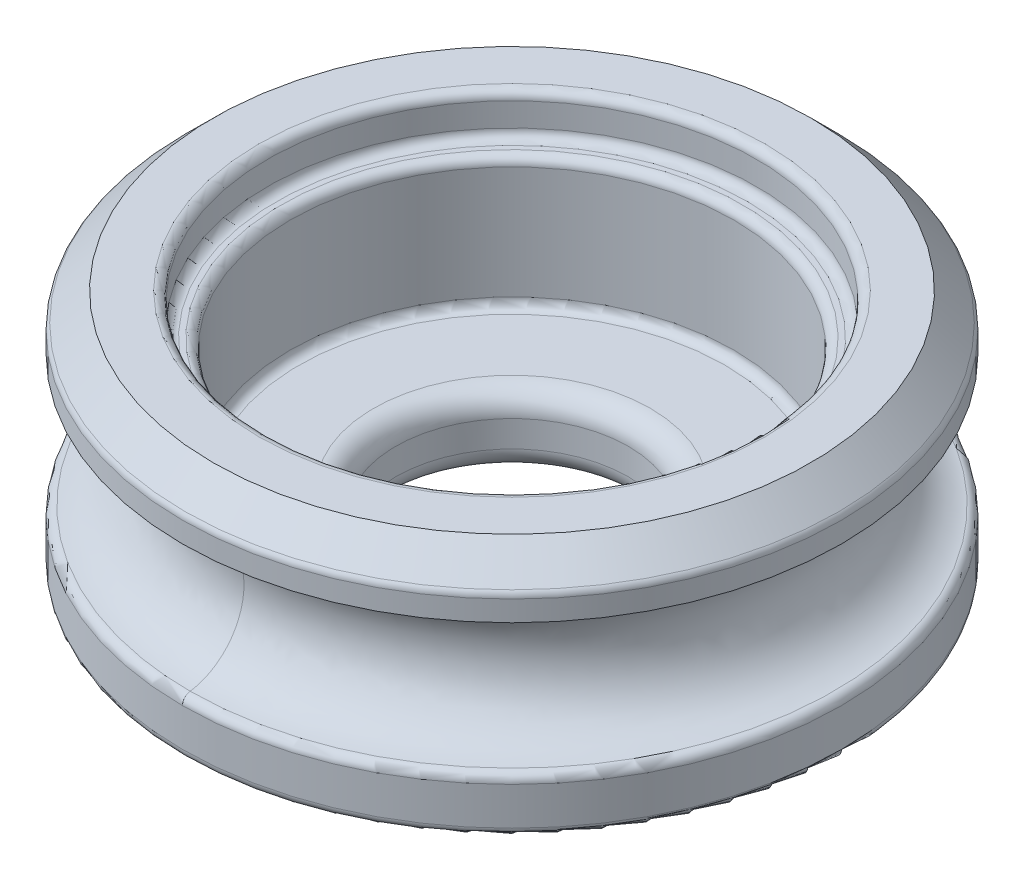
ISO-10303-21;
HEADER;
FILE_DESCRIPTION(('STEP AP214'),'2;1');
FILE_NAME('part.step','',(''),(''),'','','');
FILE_SCHEMA(('AUTOMOTIVE_DESIGN { 1 0 10303 214 1 1 1 1 }'));
ENDSEC;
DATA;
#1=APPLICATION_CONTEXT('core data for automotive mechanical design processes');
#2=APPLICATION_PROTOCOL_DEFINITION('international standard','automotive_design',2000,#1);
#3=PRODUCT_CONTEXT('',#1,'mechanical');
#4=PRODUCT('Part','Part','',(#3));
#5=PRODUCT_RELATED_PRODUCT_CATEGORY('part','',(#4));
#6=PRODUCT_DEFINITION_FORMATION('','',#4);
#7=PRODUCT_DEFINITION_CONTEXT('part definition',#1,'design');
#8=PRODUCT_DEFINITION('design','',#6,#7);
#9=PRODUCT_DEFINITION_SHAPE('','',#8);
#10=(LENGTH_UNIT() NAMED_UNIT(*) SI_UNIT(.MILLI.,.METRE.));
#11=(NAMED_UNIT(*) PLANE_ANGLE_UNIT() SI_UNIT($,.RADIAN.));
#12=(NAMED_UNIT(*) SI_UNIT($,.STERADIAN.) SOLID_ANGLE_UNIT());
#13=UNCERTAINTY_MEASURE_WITH_UNIT(LENGTH_MEASURE(1.E-05),#10,'distance_accuracy_value','');
#14=(GEOMETRIC_REPRESENTATION_CONTEXT(3) GLOBAL_UNCERTAINTY_ASSIGNED_CONTEXT((#13)) GLOBAL_UNIT_ASSIGNED_CONTEXT((#10,
#11,#12)) REPRESENTATION_CONTEXT('',''));
#15=CARTESIAN_POINT('',(0.,0.,0.));
#16=DIRECTION('',(0.,0.,1.));
#17=DIRECTION('',(1.,0.,0.));
#18=AXIS2_PLACEMENT_3D('',#15,#16,#17);
#19=CARTESIAN_POINT('',(0.,6.985,0.));
#20=DIRECTION('',(0.,-1.,0.));
#21=DIRECTION('',(0.,0.,-1.));
#22=AXIS2_PLACEMENT_3D('',#19,#20,#21);
#23=CYLINDRICAL_SURFACE('',#22,9.525);
#24=CARTESIAN_POINT('',(0.,5.99078975515723,0.));
#25=DIRECTION('',(0.,1.,0.));
#26=DIRECTION('',(0.,0.,1.));
#27=AXIS2_PLACEMENT_3D('',#24,#25,#26);
#28=CIRCLE('',#27,9.525);
#29=CARTESIAN_POINT('',(0.,5.99078975515723,9.525));
#30=VERTEX_POINT('',#29);
#31=EDGE_CURVE('E128',#30,#30,#28,.F.);
#32=ORIENTED_EDGE('',*,*,#31,.T.);
#33=EDGE_LOOP('',(#32));
#34=FACE_BOUND('',#33,.T.);
#35=CARTESIAN_POINT('',(0.,5.3975,0.));
#36=DIRECTION('',(0.,-1.,0.));
#37=DIRECTION('',(1.,0.,0.));
#38=AXIS2_PLACEMENT_3D('',#35,#36,#37);
#39=CIRCLE('',#38,9.525);
#40=CARTESIAN_POINT('',(0.,5.3975,9.525));
#41=VERTEX_POINT('',#40);
#42=CARTESIAN_POINT('',(0.,5.3975,-9.525));
#43=VERTEX_POINT('',#42);
#44=EDGE_CURVE('E77',#41,#43,#39,.F.);
#45=ORIENTED_EDGE('',*,*,#44,.T.);
#46=CARTESIAN_POINT('',(0.,5.3975,0.));
#47=DIRECTION('',(0.,-1.,0.));
#48=DIRECTION('',(1.,0.,0.));
#49=AXIS2_PLACEMENT_3D('',#46,#47,#48);
#50=CIRCLE('',#49,9.525);
#51=EDGE_CURVE('E85',#43,#41,#50,.F.);
#52=ORIENTED_EDGE('',*,*,#51,.T.);
#53=EDGE_LOOP('',(#45,#52));
#54=FACE_BOUND('',#53,.T.);
#55=ADVANCED_FACE('F40',(#34,#54),#23,.T.);
#56=CARTESIAN_POINT('',(0.,-18.1401173645597,0.));
#57=DIRECTION('',(0.,1.,0.));
#58=DIRECTION('',(0.,0.,1.));
#59=AXIS2_PLACEMENT_3D('',#56,#57,#58);
#60=CYLINDRICAL_SURFACE('',#59,6.4135);
#61=CARTESIAN_POINT('',(0.,2.286,0.));
#62=DIRECTION('',(0.,-1.,0.));
#63=DIRECTION('',(0.,0.,-1.));
#64=AXIS2_PLACEMENT_3D('',#61,#62,#63);
#65=CIRCLE('',#64,6.4135);
#66=CARTESIAN_POINT('',(0.,2.286,6.4135));
#67=VERTEX_POINT('',#66);
#68=EDGE_CURVE('E11',#67,#67,#65,.T.);
#69=CARTESIAN_POINT('',(0.,5.540375,0.));
#70=DIRECTION('',(0.,1.,0.));
#71=DIRECTION('',(0.,0.,1.));
#72=AXIS2_PLACEMENT_3D('',#69,#70,#71);
#73=CIRCLE('',#72,6.4135);
#74=CARTESIAN_POINT('',(0.,5.540375,6.4135));
#75=VERTEX_POINT('',#74);
#76=EDGE_CURVE('E106',#75,#75,#73,.T.);
#77=CARTESIAN_POINT('',(0.,2.286,6.4135));
#78=CARTESIAN_POINT('',(0.,2.31989973958334,6.4135));
#79=CARTESIAN_POINT('',(0.,2.35379947916667,6.4135));
#80=CARTESIAN_POINT('',(0.,2.42159895833334,6.4135));
#81=CARTESIAN_POINT('',(0.,2.45549869791667,6.4135));
#82=CARTESIAN_POINT('',(0.,2.52329817708334,6.4135));
#83=CARTESIAN_POINT('',(0.,2.55719791666667,6.4135));
#84=CARTESIAN_POINT('',(0.,2.62499739583334,6.4135));
#85=CARTESIAN_POINT('',(0.,2.65889713541667,6.4135));
#86=CARTESIAN_POINT('',(0.,2.72669661458334,6.4135));
#87=CARTESIAN_POINT('',(0.,2.76059635416667,6.4135));
#88=CARTESIAN_POINT('',(0.,2.82839583333334,6.4135));
#89=CARTESIAN_POINT('',(0.,2.86229557291667,6.4135));
#90=CARTESIAN_POINT('',(0.,2.93009505208334,6.4135));
#91=CARTESIAN_POINT('',(0.,2.96399479166667,6.4135));
#92=CARTESIAN_POINT('',(0.,3.03179427083334,6.4135));
#93=CARTESIAN_POINT('',(0.,3.06569401041667,6.4135));
#94=CARTESIAN_POINT('',(0.,3.13349348958334,6.4135));
#95=CARTESIAN_POINT('',(0.,3.16739322916667,6.4135));
#96=CARTESIAN_POINT('',(0.,3.23519270833334,6.4135));
#97=CARTESIAN_POINT('',(0.,3.26909244791667,6.4135));
#98=CARTESIAN_POINT('',(0.,3.33689192708334,6.4135));
#99=CARTESIAN_POINT('',(0.,3.37079166666667,6.4135));
#100=CARTESIAN_POINT('',(0.,3.43859114583334,6.4135));
#101=CARTESIAN_POINT('',(0.,3.47249088541667,6.4135));
#102=CARTESIAN_POINT('',(0.,3.54029036458334,6.4135));
#103=CARTESIAN_POINT('',(0.,3.57419010416667,6.4135));
#104=CARTESIAN_POINT('',(0.,3.64198958333334,6.4135));
#105=CARTESIAN_POINT('',(0.,3.67588932291667,6.4135));
#106=CARTESIAN_POINT('',(0.,3.74368880208334,6.4135));
#107=CARTESIAN_POINT('',(0.,3.77758854166667,6.4135));
#108=CARTESIAN_POINT('',(0.,3.84538802083333,6.4135));
#109=CARTESIAN_POINT('',(0.,3.87928776041667,6.4135));
#110=CARTESIAN_POINT('',(0.,3.94708723958334,6.4135));
#111=CARTESIAN_POINT('',(0.,3.98098697916667,6.4135));
#112=CARTESIAN_POINT('',(0.,4.04878645833334,6.4135));
#113=CARTESIAN_POINT('',(0.,4.08268619791667,6.4135));
#114=CARTESIAN_POINT('',(0.,4.15048567708333,6.4135));
#115=CARTESIAN_POINT('',(0.,4.18438541666667,6.4135));
#116=CARTESIAN_POINT('',(0.,4.25218489583333,6.4135));
#117=CARTESIAN_POINT('',(0.,4.28608463541667,6.4135));
#118=CARTESIAN_POINT('',(0.,4.35388411458334,6.4135));
#119=CARTESIAN_POINT('',(0.,4.38778385416667,6.4135));
#120=CARTESIAN_POINT('',(0.,4.45558333333334,6.4135));
#121=CARTESIAN_POINT('',(0.,4.48948307291667,6.4135));
#122=CARTESIAN_POINT('',(0.,4.55728255208333,6.4135));
#123=CARTESIAN_POINT('',(0.,4.59118229166667,6.4135));
#124=CARTESIAN_POINT('',(0.,4.65898177083333,6.4135));
#125=CARTESIAN_POINT('',(0.,4.69288151041667,6.4135));
#126=CARTESIAN_POINT('',(0.,4.76068098958333,6.4135));
#127=CARTESIAN_POINT('',(0.,4.79458072916667,6.4135));
#128=CARTESIAN_POINT('',(0.,4.86238020833333,6.4135));
#129=CARTESIAN_POINT('',(0.,4.89627994791667,6.4135));
#130=CARTESIAN_POINT('',(0.,4.96407942708333,6.4135));
#131=CARTESIAN_POINT('',(0.,4.99797916666667,6.4135));
#132=CARTESIAN_POINT('',(0.,5.06577864583333,6.4135));
#133=CARTESIAN_POINT('',(0.,5.09967838541667,6.4135));
#134=CARTESIAN_POINT('',(0.,5.16747786458333,6.4135));
#135=CARTESIAN_POINT('',(0.,5.20137760416667,6.4135));
#136=CARTESIAN_POINT('',(0.,5.26917708333333,6.4135));
#137=CARTESIAN_POINT('',(0.,5.30307682291667,6.4135));
#138=CARTESIAN_POINT('',(0.,5.37087630208333,6.4135));
#139=CARTESIAN_POINT('',(0.,5.40477604166667,6.4135));
#140=CARTESIAN_POINT('',(0.,5.47257552083333,6.4135));
#141=CARTESIAN_POINT('',(0.,5.50647526041667,6.4135));
#142=CARTESIAN_POINT('',(0.,5.540375,6.4135));
#143=B_SPLINE_CURVE_WITH_KNOTS('',3,(#77,#78,#79,#80,#81,#82,#83,#84,#85,#86,#87,#88,#89,#90,
#91,#92,#93,#94,#95,#96,#97,#98,#99,#100,#101,#102,#103,#104,#105,#106,#107,#108,#109,#110,#111,
#112,#113,#114,#115,#116,#117,#118,#119,#120,#121,#122,#123,#124,#125,#126,#127,#128,#129,#130,
#131,#132,#133,#134,#135,#136,#137,#138,#139,#140,#141,#142),.UNSPECIFIED.,.F.,.F.,(4,2,2,2,2,2,
2,2,2,2,2,2,2,2,2,2,2,2,2,2,2,2,2,2,2,2,2,2,2,2,2,2,4),(0.,0.101699218750001,0.203398437499999,
0.30509765625,0.406796875000001,0.508496093749998,0.610195312499999,0.71189453125,
0.813593750000001,0.915292968749998,1.0169921875,1.11869140625,1.220390625,1.32208984375,
1.4237890625,1.52548828125,1.6271875,1.72888671875,1.8305859375,1.93228515625,2.033984375,
2.13568359375,2.2373828125,2.33908203125,2.44078125,2.54248046875,2.6441796875,2.74587890625,
2.847578125,2.94927734375,3.0509765625,3.15267578125,3.254375),.UNSPECIFIED.);
#144=EDGE_CURVE('BSEAM180',#67,#75,#143,.T.);
#145=ORIENTED_EDGE('',*,*,#68,.T.);
#146=ORIENTED_EDGE('',*,*,#76,.T.);
#147=ORIENTED_EDGE('',*,*,#144,.T.);
#148=ORIENTED_EDGE('',*,*,#144,.F.);
#149=EDGE_LOOP('',(#145,#147,#146,#148));
#150=FACE_BOUND('',#149,.T.);
#151=ADVANCED_FACE('F180',(#150),#60,.F.);
#152=CARTESIAN_POINT('',(0.,1.35042489048623,0.));
#153=DIRECTION('',(0.,1.,0.));
#154=DIRECTION('',(-1.,0.,0.));
#155=AXIS2_PLACEMENT_3D('',#152,#153,#154);
#156=CIRCLE('',#155,9.525);
#157=CARTESIAN_POINT('',(0.,1.35042489048623,9.525));
#158=VERTEX_POINT('',#157);
#159=CARTESIAN_POINT('',(0.,1.35042489048623,-9.525));
#160=VERTEX_POINT('',#159);
#161=EDGE_CURVE('E115',#158,#160,#156,.F.);
#162=ORIENTED_EDGE('',*,*,#161,.T.);
#163=CARTESIAN_POINT('',(0.,1.35042489048623,0.));
#164=DIRECTION('',(0.,1.,0.));
#165=DIRECTION('',(-1.,0.,0.));
#166=AXIS2_PLACEMENT_3D('',#163,#164,#165);
#167=CIRCLE('',#166,9.525);
#168=EDGE_CURVE('E117',#160,#158,#167,.F.);
#169=ORIENTED_EDGE('',*,*,#168,.T.);
#170=EDGE_LOOP('',(#162,#169));
#171=FACE_BOUND('',#170,.T.);
#172=CARTESIAN_POINT('',(0.,0.254,0.));
#173=DIRECTION('',(0.,1.,0.));
#174=DIRECTION('',(0.,0.,1.));
#175=AXIS2_PLACEMENT_3D('',#172,#173,#174);
#176=CIRCLE('',#175,9.525);
#177=CARTESIAN_POINT('',(0.,0.254,9.525));
#178=VERTEX_POINT('',#177);
#179=EDGE_CURVE('E112',#178,#178,#176,.T.);
#180=ORIENTED_EDGE('',*,*,#179,.T.);
#181=EDGE_LOOP('',(#180));
#182=FACE_BOUND('',#181,.T.);
#183=ADVANCED_FACE('F183',(#171,#182),#23,.T.);
#184=CARTESIAN_POINT('',(0.,6.985,0.));
#185=DIRECTION('',(0.,1.,0.));
#186=DIRECTION('',(0.,0.,1.));
#187=AXIS2_PLACEMENT_3D('',#184,#185,#186);
#188=PLANE('',#187);
#189=CARTESIAN_POINT('',(0.,6.985,0.));
#190=DIRECTION('',(0.,1.,0.));
#191=DIRECTION('',(0.,0.,1.));
#192=AXIS2_PLACEMENT_3D('',#189,#190,#191);
#193=CIRCLE('',#192,8.636);
#194=CARTESIAN_POINT('',(0.,6.985,8.636));
#195=VERTEX_POINT('',#194);
#196=EDGE_CURVE('E109',#195,#195,#193,.T.);
#197=ORIENTED_EDGE('',*,*,#196,.T.);
#198=EDGE_LOOP('',(#197));
#199=FACE_BOUND('',#198,.T.);
#200=CARTESIAN_POINT('',(0.,6.985,0.));
#201=DIRECTION('',(0.,1.,0.));
#202=DIRECTION('',(0.,0.,1.));
#203=AXIS2_PLACEMENT_3D('',#200,#201,#202);
#204=CIRCLE('',#203,7.3263125);
#205=CARTESIAN_POINT('',(0.,6.985,7.3263125));
#206=VERTEX_POINT('',#205);
#207=EDGE_CURVE('E97',#206,#206,#204,.F.);
#208=ORIENTED_EDGE('',*,*,#207,.T.);
#209=EDGE_LOOP('',(#208));
#210=FACE_BOUND('',#209,.T.);
#211=ADVANCED_FACE('F185',(#199,#210),#188,.T.);
#212=CARTESIAN_POINT('',(0.,0.,0.));
#213=DIRECTION('',(0.,1.,0.));
#214=DIRECTION('',(0.,0.,1.));
#215=AXIS2_PLACEMENT_3D('',#212,#213,#214);
#216=PLANE('',#215);
#217=CARTESIAN_POINT('',(0.,0.,0.));
#218=DIRECTION('',(0.,1.,0.));
#219=DIRECTION('',(0.,0.,1.));
#220=AXIS2_PLACEMENT_3D('',#217,#218,#219);
#221=CIRCLE('',#220,4.0005);
#222=CARTESIAN_POINT('',(0.,0.,4.0005));
#223=VERTEX_POINT('',#222);
#224=EDGE_CURVE('E247',#223,#223,#221,.T.);
#225=ORIENTED_EDGE('',*,*,#224,.T.);
#226=EDGE_LOOP('',(#225));
#227=FACE_BOUND('',#226,.T.);
#228=CARTESIAN_POINT('',(0.,0.,0.));
#229=DIRECTION('',(0.,1.,0.));
#230=DIRECTION('',(0.,0.,1.));
#231=AXIS2_PLACEMENT_3D('',#228,#229,#230);
#232=CIRCLE('',#231,9.271);
#233=CARTESIAN_POINT('',(0.,0.,9.271));
#234=VERTEX_POINT('',#233);
#235=EDGE_CURVE('E150',#234,#234,#232,.F.);
#236=ORIENTED_EDGE('',*,*,#235,.T.);
#237=EDGE_LOOP('',(#236));
#238=FACE_BOUND('',#237,.T.);
#239=ADVANCED_FACE('F175',(#227,#238),#216,.F.);
#240=CARTESIAN_POINT('',(0.,5.794375,0.));
#241=DIRECTION('',(0.,1.,0.));
#242=DIRECTION('',(0.,0.,1.));
#243=AXIS2_PLACEMENT_3D('',#240,#241,#242);
#244=PLANE('',#243);
#245=CARTESIAN_POINT('',(0.,5.794375,0.));
#246=DIRECTION('',(0.,1.,0.));
#247=DIRECTION('',(0.,0.,1.));
#248=AXIS2_PLACEMENT_3D('',#245,#246,#247);
#249=CIRCLE('',#248,6.8183125);
#250=CARTESIAN_POINT('',(0.,5.794375,6.8183125));
#251=VERTEX_POINT('',#250);
#252=EDGE_CURVE('E103',#251,#251,#249,.T.);
#253=ORIENTED_EDGE('',*,*,#252,.T.);
#254=EDGE_LOOP('',(#253));
#255=FACE_BOUND('',#254,.T.);
#256=CARTESIAN_POINT('',(0.,5.794375,0.));
#257=DIRECTION('',(0.,1.,0.));
#258=DIRECTION('',(0.,0.,1.));
#259=AXIS2_PLACEMENT_3D('',#256,#257,#258);
#260=CIRCLE('',#259,6.6675);
#261=CARTESIAN_POINT('',(0.,5.794375,6.6675));
#262=VERTEX_POINT('',#261);
#263=EDGE_CURVE('E100',#262,#262,#260,.F.);
#264=ORIENTED_EDGE('',*,*,#263,.T.);
#265=EDGE_LOOP('',(#264));
#266=FACE_BOUND('',#265,.T.);
#267=ADVANCED_FACE('F172',(#255,#266),#244,.T.);
#268=CARTESIAN_POINT('',(0.,5.794375,0.));
#269=DIRECTION('',(0.,1.,0.));
#270=DIRECTION('',(0.,0.,1.));
#271=AXIS2_PLACEMENT_3D('',#268,#269,#270);
#272=CYLINDRICAL_SURFACE('',#271,7.0723125);
#273=CARTESIAN_POINT('',(0.,6.731,0.));
#274=DIRECTION('',(0.,1.,0.));
#275=DIRECTION('',(0.,0.,1.));
#276=AXIS2_PLACEMENT_3D('',#273,#274,#275);
#277=CIRCLE('',#276,7.0723125);
#278=CARTESIAN_POINT('',(0.,6.731,7.0723125));
#279=VERTEX_POINT('',#278);
#280=EDGE_CURVE('E92',#279,#279,#277,.T.);
#281=CARTESIAN_POINT('',(0.,6.048375,0.));
#282=DIRECTION('',(0.,1.,0.));
#283=DIRECTION('',(0.,0.,1.));
#284=AXIS2_PLACEMENT_3D('',#281,#282,#283);
#285=CIRCLE('',#284,7.0723125);
#286=CARTESIAN_POINT('',(0.,6.048375,7.0723125));
#287=VERTEX_POINT('',#286);
#288=EDGE_CURVE('E89',#287,#287,#285,.F.);
#289=CARTESIAN_POINT('',(0.,6.731,7.0723125));
#290=CARTESIAN_POINT('',(0.,6.72388932291667,7.0723125));
#291=CARTESIAN_POINT('',(0.,6.71677864583333,7.0723125));
#292=CARTESIAN_POINT('',(0.,6.70255729166667,7.0723125));
#293=CARTESIAN_POINT('',(0.,6.69544661458333,7.0723125));
#294=CARTESIAN_POINT('',(0.,6.68122526041667,7.0723125));
#295=CARTESIAN_POINT('',(0.,6.67411458333333,7.0723125));
#296=CARTESIAN_POINT('',(0.,6.65989322916667,7.0723125));
#297=CARTESIAN_POINT('',(0.,6.65278255208333,7.0723125));
#298=CARTESIAN_POINT('',(0.,6.63856119791667,7.0723125));
#299=CARTESIAN_POINT('',(0.,6.63145052083333,7.0723125));
#300=CARTESIAN_POINT('',(0.,6.61722916666667,7.0723125));
#301=CARTESIAN_POINT('',(0.,6.61011848958333,7.0723125));
#302=CARTESIAN_POINT('',(0.,6.59589713541667,7.0723125));
#303=CARTESIAN_POINT('',(0.,6.58878645833333,7.0723125));
#304=CARTESIAN_POINT('',(0.,6.57456510416667,7.0723125));
#305=CARTESIAN_POINT('',(0.,6.56745442708333,7.0723125));
#306=CARTESIAN_POINT('',(0.,6.55323307291667,7.0723125));
#307=CARTESIAN_POINT('',(0.,6.54612239583333,7.0723125));
#308=CARTESIAN_POINT('',(0.,6.53190104166667,7.0723125));
#309=CARTESIAN_POINT('',(0.,6.52479036458333,7.0723125));
#310=CARTESIAN_POINT('',(0.,6.51056901041667,7.0723125));
#311=CARTESIAN_POINT('',(0.,6.50345833333333,7.0723125));
#312=CARTESIAN_POINT('',(0.,6.48923697916667,7.0723125));
#313=CARTESIAN_POINT('',(0.,6.48212630208333,7.0723125));
#314=CARTESIAN_POINT('',(0.,6.46790494791667,7.0723125));
#315=CARTESIAN_POINT('',(0.,6.46079427083333,7.0723125));
#316=CARTESIAN_POINT('',(0.,6.44657291666667,7.0723125));
#317=CARTESIAN_POINT('',(0.,6.43946223958333,7.0723125));
#318=CARTESIAN_POINT('',(0.,6.42524088541667,7.0723125));
#319=CARTESIAN_POINT('',(0.,6.41813020833333,7.0723125));
#320=CARTESIAN_POINT('',(0.,6.40390885416667,7.0723125));
#321=CARTESIAN_POINT('',(0.,6.39679817708333,7.0723125));
#322=CARTESIAN_POINT('',(0.,6.38257682291667,7.0723125));
#323=CARTESIAN_POINT('',(0.,6.37546614583333,7.0723125));
#324=CARTESIAN_POINT('',(0.,6.36124479166667,7.0723125));
#325=CARTESIAN_POINT('',(0.,6.35413411458333,7.0723125));
#326=CARTESIAN_POINT('',(0.,6.33991276041667,7.0723125));
#327=CARTESIAN_POINT('',(0.,6.33280208333333,7.0723125));
#328=CARTESIAN_POINT('',(0.,6.31858072916667,7.0723125));
#329=CARTESIAN_POINT('',(0.,6.31147005208333,7.0723125));
#330=CARTESIAN_POINT('',(0.,6.29724869791667,7.0723125));
#331=CARTESIAN_POINT('',(0.,6.29013802083333,7.0723125));
#332=CARTESIAN_POINT('',(0.,6.27591666666667,7.0723125));
#333=CARTESIAN_POINT('',(0.,6.26880598958333,7.0723125));
#334=CARTESIAN_POINT('',(0.,6.25458463541667,7.0723125));
#335=CARTESIAN_POINT('',(0.,6.24747395833333,7.0723125));
#336=CARTESIAN_POINT('',(0.,6.23325260416667,7.0723125));
#337=CARTESIAN_POINT('',(0.,6.22614192708333,7.0723125));
#338=CARTESIAN_POINT('',(0.,6.21192057291667,7.0723125));
#339=CARTESIAN_POINT('',(0.,6.20480989583333,7.0723125));
#340=CARTESIAN_POINT('',(0.,6.19058854166667,7.0723125));
#341=CARTESIAN_POINT('',(0.,6.18347786458333,7.0723125));
#342=CARTESIAN_POINT('',(0.,6.16925651041667,7.0723125));
#343=CARTESIAN_POINT('',(0.,6.16214583333333,7.0723125));
#344=CARTESIAN_POINT('',(0.,6.14792447916667,7.0723125));
#345=CARTESIAN_POINT('',(0.,6.14081380208333,7.0723125));
#346=CARTESIAN_POINT('',(0.,6.12659244791667,7.0723125));
#347=CARTESIAN_POINT('',(0.,6.11948177083333,7.0723125));
#348=CARTESIAN_POINT('',(0.,6.10526041666667,7.0723125));
#349=CARTESIAN_POINT('',(0.,6.09814973958333,7.0723125));
#350=CARTESIAN_POINT('',(0.,6.08392838541667,7.0723125));
#351=CARTESIAN_POINT('',(0.,6.07681770833333,7.0723125));
#352=CARTESIAN_POINT('',(0.,6.06259635416667,7.0723125));
#353=CARTESIAN_POINT('',(0.,6.05548567708333,7.0723125));
#354=CARTESIAN_POINT('',(0.,6.048375,7.0723125));
#355=B_SPLINE_CURVE_WITH_KNOTS('',3,(#289,#290,#291,#292,#293,#294,#295,#296,#297,#298,#299,
#300,#301,#302,#303,#304,#305,#306,#307,#308,#309,#310,#311,#312,#313,#314,#315,#316,#317,#318,
#319,#320,#321,#322,#323,#324,#325,#326,#327,#328,#329,#330,#331,#332,#333,#334,#335,#336,#337,
#338,#339,#340,#341,#342,#343,#344,#345,#346,#347,#348,#349,#350,#351,#352,#353,#354),
.UNSPECIFIED.,.F.,.F.,(4,2,2,2,2,2,2,2,2,2,2,2,2,2,2,2,2,2,2,2,2,2,2,2,2,2,2,2,2,2,2,2,4),(0.,
0.0213320312499998,0.0426640624999995,0.0639960937500001,0.0853281249999999,0.10666015625,
0.127992187499999,0.14932421875,0.17065625,0.19198828125,0.213320312499999,0.23465234375,
0.255984375,0.277316406249999,0.298648437499999,0.31998046875,0.3413125,0.362644531249999,
0.3839765625,0.40530859375,0.426640624999999,0.447972656249999,0.4693046875,0.49063671875,
0.511968749999999,0.533300781249999,0.5546328125,0.57596484375,0.597296874999999,0.61862890625,
0.6399609375,0.661292968749999,0.682624999999999),.UNSPECIFIED.);
#356=EDGE_CURVE('BSEAM170',#279,#287,#355,.T.);
#357=ORIENTED_EDGE('',*,*,#280,.T.);
#358=ORIENTED_EDGE('',*,*,#288,.T.);
#359=ORIENTED_EDGE('',*,*,#356,.T.);
#360=ORIENTED_EDGE('',*,*,#356,.F.);
#361=EDGE_LOOP('',(#357,#359,#358,#360));
#362=FACE_BOUND('',#361,.T.);
#363=ADVANCED_FACE('F170',(#362),#272,.F.);
#364=CARTESIAN_POINT('',(0.,2.032,0.));
#365=DIRECTION('',(0.,-1.,0.));
#366=DIRECTION('',(0.,0.,-1.));
#367=AXIS2_PLACEMENT_3D('',#364,#365,#366);
#368=PLANE('',#367);
#369=CARTESIAN_POINT('',(0.,2.032,0.));
#370=DIRECTION('',(0.,-1.,0.));
#371=DIRECTION('',(0.,0.,-1.));
#372=AXIS2_PLACEMENT_3D('',#369,#370,#371);
#373=CIRCLE('',#372,6.1595);
#374=CARTESIAN_POINT('',(0.,2.032,-6.1595));
#375=VERTEX_POINT('',#374);
#376=EDGE_CURVE('E48',#375,#375,#373,.F.);
#377=ORIENTED_EDGE('',*,*,#376,.T.);
#378=EDGE_LOOP('',(#377));
#379=FACE_BOUND('',#378,.T.);
#380=CARTESIAN_POINT('',(0.,2.032,0.));
#381=DIRECTION('',(0.,-1.,0.));
#382=DIRECTION('',(0.,0.,-1.));
#383=AXIS2_PLACEMENT_3D('',#380,#381,#382);
#384=CIRCLE('',#383,4.0005);
#385=CARTESIAN_POINT('',(0.,2.032,-4.0005));
#386=VERTEX_POINT('',#385);
#387=EDGE_CURVE('E253',#386,#386,#384,.T.);
#388=ORIENTED_EDGE('',*,*,#387,.T.);
#389=EDGE_LOOP('',(#388));
#390=FACE_BOUND('',#389,.T.);
#391=ADVANCED_FACE('F166',(#379,#390),#368,.F.);
#392=CARTESIAN_POINT('',(0.,2.032,0.));
#393=DIRECTION('',(0.,-1.,0.));
#394=DIRECTION('',(0.,0.,-1.));
#395=AXIS2_PLACEMENT_3D('',#392,#393,#394);
#396=CYLINDRICAL_SURFACE('',#395,3.3655);
#397=CARTESIAN_POINT('',(0.,1.397,0.));
#398=DIRECTION('',(0.,-1.,0.));
#399=DIRECTION('',(0.,0.,-1.));
#400=AXIS2_PLACEMENT_3D('',#397,#398,#399);
#401=CIRCLE('',#400,3.3655);
#402=CARTESIAN_POINT('',(0.,1.397,-3.3655));
#403=VERTEX_POINT('',#402);
#404=EDGE_CURVE('E252',#403,#403,#401,.F.);
#405=ORIENTED_EDGE('',*,*,#404,.T.);
#406=EDGE_LOOP('',(#405));
#407=FACE_BOUND('',#406,.T.);
#408=CARTESIAN_POINT('',(0.,0.635,0.));
#409=DIRECTION('',(0.,1.,0.));
#410=DIRECTION('',(0.,0.,1.));
#411=AXIS2_PLACEMENT_3D('',#408,#409,#410);
#412=CIRCLE('',#411,3.3655);
#413=CARTESIAN_POINT('',(0.,0.635,3.3655));
#414=VERTEX_POINT('',#413);
#415=EDGE_CURVE('E250',#414,#414,#412,.F.);
#416=ORIENTED_EDGE('',*,*,#415,.T.);
#417=EDGE_LOOP('',(#416));
#418=FACE_BOUND('',#417,.T.);
#419=ADVANCED_FACE('F158',(#407,#418),#396,.F.);
#420=CARTESIAN_POINT('',(0.,1.5875,9.525));
#421=CARTESIAN_POINT('',(-19.05,1.5875,9.525));
#422=CARTESIAN_POINT('',(-19.05,1.5875,-9.525));
#423=CARTESIAN_POINT('',(0.,1.5875,-9.525));
#424=CARTESIAN_POINT('',(0.,1.5875,13.081));
#425=CARTESIAN_POINT('',(-26.162,1.5875,13.081));
#426=CARTESIAN_POINT('',(-26.162,1.5875,-13.081));
#427=CARTESIAN_POINT('',(0.,1.5875,-13.081));
#428=CARTESIAN_POINT('',(0.,5.3975,13.081));
#429=CARTESIAN_POINT('',(-26.162,5.3975,13.081));
#430=CARTESIAN_POINT('',(-26.162,5.3975,-13.081));
#431=CARTESIAN_POINT('',(0.,5.3975,-13.081));
#432=CARTESIAN_POINT('',(0.,5.3975,9.525));
#433=CARTESIAN_POINT('',(-19.05,5.3975,9.525));
#434=CARTESIAN_POINT('',(-19.05,5.3975,-9.525));
#435=CARTESIAN_POINT('',(0.,5.3975,-9.525));
#436=CARTESIAN_POINT('',(0.,5.3975,5.969));
#437=CARTESIAN_POINT('',(-11.938,5.3975,5.969));
#438=CARTESIAN_POINT('',(-11.938,5.3975,-5.969));
#439=CARTESIAN_POINT('',(0.,5.3975,-5.969));
#440=CARTESIAN_POINT('',(0.,1.5875,5.969));
#441=CARTESIAN_POINT('',(-11.938,1.5875,5.969));
#442=CARTESIAN_POINT('',(-11.938,1.5875,-5.969));
#443=CARTESIAN_POINT('',(0.,1.5875,-5.969));
#444=CARTESIAN_POINT('',(0.,1.5875,9.525));
#445=CARTESIAN_POINT('',(-19.05,1.5875,9.525));
#446=CARTESIAN_POINT('',(-19.05,1.5875,-9.525));
#447=CARTESIAN_POINT('',(0.,1.5875,-9.525));
#448=(BOUNDED_SURFACE() B_SPLINE_SURFACE(3,3,((#420,#421,#422,#423),(#424,#425,#426,#427),(#428,
#429,#430,#431),(#432,#433,#434,#435),(#436,#437,#438,#439),(#440,#441,#442,#443),(#444,#445,
#446,#447)),.UNSPECIFIED.,.T.,.F.,.F.) B_SPLINE_SURFACE_WITH_KNOTS((4,3,4),(4,4),(0.,0.5,1.),
(0.,1.),.UNSPECIFIED.) GEOMETRIC_REPRESENTATION_ITEM() RATIONAL_B_SPLINE_SURFACE(((1.,
0.333333333333333,0.333333333333333,1.),(0.333333333333333,0.111111111111111,0.111111111111111,
0.333333333333333),(0.333333333333333,0.111111111111111,0.111111111111111,0.333333333333333),
(1.,0.333333333333333,0.333333333333333,1.),(0.333333333333333,0.111111111111111,
0.111111111111111,0.333333333333333),(0.333333333333333,0.111111111111111,0.111111111111111,
0.333333333333333),(1.,0.333333333333333,0.333333333333333,1.))) REPRESENTATION_ITEM('') SURFACE());
#449=CARTESIAN_POINT('',(0.,3.4925,-9.525));
#450=DIRECTION('',(1.,0.,0.));
#451=DIRECTION('',(0.,-1.,0.));
#452=AXIS2_PLACEMENT_3D('',#449,#450,#451);
#453=ELLIPSE('',#452,1.905,1.778);
#454=CARTESIAN_POINT('',(0.,1.60218154221121,-9.3046836505181));
#455=VERTEX_POINT('',#454);
#456=EDGE_CURVE('E81',#43,#455,#453,.T.);
#457=CARTESIAN_POINT('',(0.,1.60218154221121,-9.3046836505181));
#458=CARTESIAN_POINT('',(-0.261732462230386,1.60218154221121,-9.30471180830127));
#459=CARTESIAN_POINT('',(-0.523460907656867,1.60218154221121,-9.29364138141913));
#460=CARTESIAN_POINT('',(-1.04504503449442,1.60218154221121,-9.24950669186439));
#461=CARTESIAN_POINT('',(-1.30490080340461,1.60218154221121,-9.21644346360916));
#462=CARTESIAN_POINT('',(-1.82064879987601,1.60218154221121,-9.12856923777033));
#463=CARTESIAN_POINT('',(-2.07654463769508,1.60218154221121,-9.07377943046035));
#464=CARTESIAN_POINT('',(-2.58281102437684,1.60218154221121,-8.94285055851056));
#465=CARTESIAN_POINT('',(-2.83318165036085,1.60218154221121,-8.86671179206466));
#466=CARTESIAN_POINT('',(-3.32671465141433,1.60218154221121,-8.69359085076048));
#467=CARTESIAN_POINT('',(-3.56987431334104,1.60218154221121,-8.59660094105061));
#468=CARTESIAN_POINT('',(-4.0471651279261,1.60218154221121,-8.38248211708478));
#469=CARTESIAN_POINT('',(-4.28129608534765,1.60218154221121,-8.26535276763201));
#470=CARTESIAN_POINT('',(-4.73891840700092,1.60218154221121,-8.01175636947949));
#471=CARTESIAN_POINT('',(-4.96240703445689,1.60218154221121,-7.87528438213325));
#472=CARTESIAN_POINT('',(-5.39708555707905,1.60218154221121,-7.5839997083683));
#473=CARTESIAN_POINT('',(-5.60827577493575,1.60218154221121,-7.42918750349114));
#474=CARTESIAN_POINT('',(-6.01700302513791,1.60218154221121,-7.10220761872318));
#475=CARTESIAN_POINT('',(-6.21453054714989,1.60218154221121,-6.93002805067507));
#476=CARTESIAN_POINT('',(-6.59436178595641,1.60218154221121,-6.56963226148853));
#477=CARTESIAN_POINT('',(-6.77666583423693,1.60218154221121,-6.38141638971557));
#478=CARTESIAN_POINT('',(-7.1245141659546,1.60218154221121,-5.99055782940873));
#479=CARTESIAN_POINT('',(-7.29008143004663,1.60218154221121,-5.78793559166432));
#480=CARTESIAN_POINT('',(-7.60351324783681,1.60218154221121,-5.36954570678529));
#481=CARTESIAN_POINT('',(-7.75138414719209,1.60218154221121,-5.15378281382757));
#482=CARTESIAN_POINT('',(-8.02657149674843,1.60218154221121,-4.71357141319989));
#483=CARTESIAN_POINT('',(-8.1541384194372,1.60218154221121,-4.48927942883002));
#484=CARTESIAN_POINT('',(-8.39024253020534,1.60218154221121,-4.03081507434612));
#485=CARTESIAN_POINT('',(-8.49877444377039,1.60218154221121,-3.79663998790028));
#486=CARTESIAN_POINT('',(-8.6974155381216,1.60218154221121,-3.31670063392808));
#487=CARTESIAN_POINT('',(-8.78724142924674,1.60218154221121,-3.0708190644768));
#488=CARTESIAN_POINT('',(-8.94589887000944,1.60218154221121,-2.57225514073747));
#489=CARTESIAN_POINT('',(-9.0147211801471,1.60218154221121,-2.31956984651887));
#490=CARTESIAN_POINT('',(-9.13082599876865,1.60218154221121,-1.80931243841165));
#491=CARTESIAN_POINT('',(-9.1781096601938,1.60218154221121,-1.55174058686431));
#492=CARTESIAN_POINT('',(-9.25079014574106,1.60218154221121,-1.03364203502144));
#493=CARTESIAN_POINT('',(-9.27619659313321,1.60218154221121,-0.773116685047988));
#494=CARTESIAN_POINT('',(-9.30477526009017,1.60218154221121,-0.254526155647799));
#495=CARTESIAN_POINT('',(-9.30825501605723,1.60218154221121,0.00352212448701434));
#496=CARTESIAN_POINT('',(-9.29377482717045,1.60218154221121,0.519007354704632));
#497=CARTESIAN_POINT('',(-9.27581563665155,1.60218154221121,0.776444325977163));
#498=CARTESIAN_POINT('',(-9.21817607737028,1.60218154221121,1.29257359158226));
#499=CARTESIAN_POINT('',(-9.17819141404045,1.60218154221121,1.55123195160436));
#500=CARTESIAN_POINT('',(-9.07655970608686,1.60218154221121,2.06437489938981));
#501=CARTESIAN_POINT('',(-9.01490312837516,1.60218154221121,2.31885759870788));
#502=CARTESIAN_POINT('',(-8.87034867702509,1.60218154221121,2.82179597918671));
#503=CARTESIAN_POINT('',(-8.78744471588976,1.60218154221121,3.07024991070197));
#504=CARTESIAN_POINT('',(-8.60103429899128,1.60218154221121,3.55918060087006));
#505=CARTESIAN_POINT('',(-8.49753691067523,1.60218154221121,3.7996608162369));
#506=CARTESIAN_POINT('',(-8.27220451289022,1.60218154221121,4.26782557384146));
#507=CARTESIAN_POINT('',(-8.15063932887717,1.60218154221121,4.49564003871677));
#508=CARTESIAN_POINT('',(-7.88915519698639,1.60218154221121,4.94011870169187));
#509=CARTESIAN_POINT('',(-7.74925809321524,1.60218154221121,5.15679574980242));
#510=CARTESIAN_POINT('',(-7.45190267052464,1.60218154221121,5.57787996915518));
#511=CARTESIAN_POINT('',(-7.29443708000387,1.60218154221121,5.7822820055213));
#512=CARTESIAN_POINT('',(-6.96302180587994,1.60218154221121,6.17737591061377));
#513=CARTESIAN_POINT('',(-6.78906635099533,1.60218154221121,6.36806293785731));
#514=CARTESIAN_POINT('',(-6.42346290722326,1.60218154221121,6.73680768500488));
#515=CARTESIAN_POINT('',(-6.23160759706579,1.60218154221121,6.91465991646964));
#516=CARTESIAN_POINT('',(-5.83360280755841,1.60218154221121,7.25358800757261));
#517=CARTESIAN_POINT('',(-5.62745294031506,1.60218154221121,7.41466341166214));
#518=CARTESIAN_POINT('',(-5.2019832793938,1.60218154221121,7.71913527484969));
#519=CARTESIAN_POINT('',(-4.98264280297318,1.60218154221121,7.86250283364606));
#520=CARTESIAN_POINT('',(-4.53265742369027,1.60218154221121,8.13023342195885));
#521=CARTESIAN_POINT('',(-4.3020126218617,1.60218154221121,8.25459662128806));
#522=CARTESIAN_POINT('',(-3.83104291245116,1.60218154221121,8.48344266116995));
#523=CARTESIAN_POINT('',(-3.59071732278824,1.60218154221121,8.58792409793081));
#524=CARTESIAN_POINT('',(-3.10211740524384,1.60218154221121,8.776249209437));
#525=CARTESIAN_POINT('',(-2.85384329047181,1.60218154221121,8.86009343696779));
#526=CARTESIAN_POINT('',(-2.3514868871397,1.60218154221121,9.00644201947931));
#527=CARTESIAN_POINT('',(-2.0974137093651,1.60218154221121,9.06897767989602));
#528=CARTESIAN_POINT('',(-1.58500325566002,1.60218154221121,9.1724136231093));
#529=CARTESIAN_POINT('',(-1.32666803413643,1.60218154221121,9.21332403271448));
#530=CARTESIAN_POINT('',(-0.889887069345778,1.60218154221121,9.26375075161928));
#531=CARTESIAN_POINT('',(-0.712094297187166,1.60218154221121,9.27910911838492));
#532=CARTESIAN_POINT('',(-0.356206628995532,1.60218154221121,9.29956910465881));
#533=CARTESIAN_POINT('',(-0.178112679104,1.60218154221121,9.30468718447485));
#534=CARTESIAN_POINT('',(0.,1.60218154221121,9.3046836505181));
#535=B_SPLINE_CURVE_WITH_KNOTS('',3,(#457,#458,#459,#460,#461,#462,#463,#464,#465,#466,#467,
#468,#469,#470,#471,#472,#473,#474,#475,#476,#477,#478,#479,#480,#481,#482,#483,#484,#485,#486,
#487,#488,#489,#490,#491,#492,#493,#494,#495,#496,#497,#498,#499,#500,#501,#502,#503,#504,#505,
#506,#507,#508,#509,#510,#511,#512,#513,#514,#515,#516,#517,#518,#519,#520,#521,#522,#523,#524,
#525,#526,#527,#528,#529,#530,#531,#532,#533,#534),.UNSPECIFIED.,.F.,.F.,(4,2,2,2,2,2,2,2,2,2,2,
2,2,2,2,2,2,2,2,2,2,2,2,2,2,2,2,2,2,2,2,2,2,2,2,2,2,2,4),(0.,0.784957720462846,1.5698785235504,
2.35403565655535,3.13818183730479,3.92261940506802,4.70707392601598,5.49172909933072,
6.27636367526906,7.06153903505226,7.84669729344692,8.63076240350857,9.41454551148096,
10.1877505337726,10.961169470313,11.7455638517246,12.5303027934184,13.3149997239225,
14.0993513081854,14.8726768920444,15.6459752670426,16.430235343995,17.2148408355689,
17.999671372895,18.7841571048594,19.5579259687727,20.3307810632501,21.1039572377423,
21.8774050220664,22.6613047949225,23.4452258478127,24.2304098612261,25.0155868582452,
25.800819273711,26.586030653759,27.3700834175115,28.153768694101,28.6888568887321,
29.2230842856928),.UNSPECIFIED.);
#536=CARTESIAN_POINT('',(0.,1.60218154221121,9.3046836505181));
#537=VERTEX_POINT('',#536);
#538=EDGE_CURVE('E62',#455,#537,#535,.T.);
#539=CARTESIAN_POINT('',(0.,3.4925,9.525));
#540=DIRECTION('',(-1.,0.,0.));
#541=DIRECTION('',(0.,-1.,0.));
#542=AXIS2_PLACEMENT_3D('',#539,#540,#541);
#543=ELLIPSE('',#542,1.905,1.778);
#544=EDGE_CURVE('E80',#41,#537,#543,.T.);
#545=ORIENTED_EDGE('',*,*,#456,.T.);
#546=ORIENTED_EDGE('',*,*,#538,.T.);
#547=ORIENTED_EDGE('',*,*,#544,.F.);
#548=ORIENTED_EDGE('',*,*,#51,.F.);
#549=EDGE_LOOP('',(#545,#546,#547,#548));
#550=FACE_BOUND('',#549,.T.);
#551=ADVANCED_FACE('F87',(#550),#448,.F.);
#552=CARTESIAN_POINT('',(0.,1.5875,-9.525));
#553=CARTESIAN_POINT('',(19.05,1.5875,-9.525));
#554=CARTESIAN_POINT('',(19.05,1.5875,9.525));
#555=CARTESIAN_POINT('',(0.,1.5875,9.525));
#556=CARTESIAN_POINT('',(0.,1.5875,-13.081));
#557=CARTESIAN_POINT('',(26.162,1.5875,-13.081));
#558=CARTESIAN_POINT('',(26.162,1.5875,13.081));
#559=CARTESIAN_POINT('',(0.,1.5875,13.081));
#560=CARTESIAN_POINT('',(0.,5.3975,-13.081));
#561=CARTESIAN_POINT('',(26.162,5.3975,-13.081));
#562=CARTESIAN_POINT('',(26.162,5.3975,13.081));
#563=CARTESIAN_POINT('',(0.,5.3975,13.081));
#564=CARTESIAN_POINT('',(0.,5.3975,-9.525));
#565=CARTESIAN_POINT('',(19.05,5.3975,-9.525));
#566=CARTESIAN_POINT('',(19.05,5.3975,9.525));
#567=CARTESIAN_POINT('',(0.,5.3975,9.525));
#568=CARTESIAN_POINT('',(0.,5.3975,-5.969));
#569=CARTESIAN_POINT('',(11.938,5.3975,-5.969));
#570=CARTESIAN_POINT('',(11.938,5.3975,5.969));
#571=CARTESIAN_POINT('',(0.,5.3975,5.969));
#572=CARTESIAN_POINT('',(0.,1.5875,-5.969));
#573=CARTESIAN_POINT('',(11.938,1.5875,-5.969));
#574=CARTESIAN_POINT('',(11.938,1.5875,5.969));
#575=CARTESIAN_POINT('',(0.,1.5875,5.969));
#576=CARTESIAN_POINT('',(0.,1.5875,-9.525));
#577=CARTESIAN_POINT('',(19.05,1.5875,-9.525));
#578=CARTESIAN_POINT('',(19.05,1.5875,9.525));
#579=CARTESIAN_POINT('',(0.,1.5875,9.525));
#580=(BOUNDED_SURFACE() B_SPLINE_SURFACE(3,3,((#552,#553,#554,#555),(#556,#557,#558,#559),(#560,
#561,#562,#563),(#564,#565,#566,#567),(#568,#569,#570,#571),(#572,#573,#574,#575),(#576,#577,
#578,#579)),.UNSPECIFIED.,.T.,.F.,.F.) B_SPLINE_SURFACE_WITH_KNOTS((4,3,4),(4,4),(0.,0.5,1.),
(0.,1.),.UNSPECIFIED.) GEOMETRIC_REPRESENTATION_ITEM() RATIONAL_B_SPLINE_SURFACE(((1.,
0.333333333333333,0.333333333333333,1.),(0.333333333333333,0.111111111111111,0.111111111111111,
0.333333333333333),(0.333333333333333,0.111111111111111,0.111111111111111,0.333333333333333),
(1.,0.333333333333333,0.333333333333333,1.),(0.333333333333333,0.111111111111111,
0.111111111111111,0.333333333333333),(0.333333333333333,0.111111111111111,0.111111111111111,
0.333333333333333),(1.,0.333333333333333,0.333333333333333,1.))) REPRESENTATION_ITEM('') SURFACE());
#581=CARTESIAN_POINT('',(0.,1.60218154221121,9.3046836505181));
#582=CARTESIAN_POINT('',(0.261732462230388,1.60218154221121,9.30471180830127));
#583=CARTESIAN_POINT('',(0.523460907656869,1.60218154221121,9.29364138141913));
#584=CARTESIAN_POINT('',(1.04504503449442,1.60218154221121,9.24950669186439));
#585=CARTESIAN_POINT('',(1.30490080340461,1.60218154221121,9.21644346360916));
#586=CARTESIAN_POINT('',(1.82064879987602,1.60218154221121,9.12856923777032));
#587=CARTESIAN_POINT('',(2.07654463769508,1.60218154221121,9.07377943046035));
#588=CARTESIAN_POINT('',(2.58281102437685,1.60218154221121,8.94285055851056));
#589=CARTESIAN_POINT('',(2.83318165036086,1.60218154221121,8.86671179206466));
#590=CARTESIAN_POINT('',(3.32671465141434,1.60218154221121,8.69359085076048));
#591=CARTESIAN_POINT('',(3.56987431334104,1.60218154221121,8.59660094105061));
#592=CARTESIAN_POINT('',(4.0471651279261,1.60218154221121,8.38248211708478));
#593=CARTESIAN_POINT('',(4.28129608534766,1.60218154221121,8.26535276763201));
#594=CARTESIAN_POINT('',(4.73891840700092,1.60218154221121,8.01175636947949));
#595=CARTESIAN_POINT('',(4.96240703445689,1.60218154221121,7.87528438213325));
#596=CARTESIAN_POINT('',(5.39708555707905,1.60218154221121,7.58399970836829));
#597=CARTESIAN_POINT('',(5.60827577493575,1.60218154221121,7.42918750349113));
#598=CARTESIAN_POINT('',(6.01700302513791,1.60218154221121,7.10220761872317));
#599=CARTESIAN_POINT('',(6.2145305471499,1.60218154221121,6.93002805067507));
#600=CARTESIAN_POINT('',(6.59436178595641,1.60218154221121,6.56963226148852));
#601=CARTESIAN_POINT('',(6.77666583423693,1.60218154221121,6.38141638971556));
#602=CARTESIAN_POINT('',(7.1245141659546,1.60218154221121,5.99055782940873));
#603=CARTESIAN_POINT('',(7.29008143004663,1.60218154221121,5.78793559166432));
#604=CARTESIAN_POINT('',(7.60351324783681,1.60218154221121,5.36954570678529));
#605=CARTESIAN_POINT('',(7.75138414719209,1.60218154221121,5.15378281382757));
#606=CARTESIAN_POINT('',(8.02657149674843,1.60218154221121,4.71357141319988));
#607=CARTESIAN_POINT('',(8.1541384194372,1.60218154221121,4.48927942883001));
#608=CARTESIAN_POINT('',(8.39024253020534,1.60218154221121,4.03081507434612));
#609=CARTESIAN_POINT('',(8.49877444377039,1.60218154221121,3.79663998790028));
#610=CARTESIAN_POINT('',(8.69741553812161,1.60218154221121,3.31670063392808));
#611=CARTESIAN_POINT('',(8.78724142924675,1.60218154221121,3.0708190644768));
#612=CARTESIAN_POINT('',(8.94589887000944,1.60218154221121,2.57225514073747));
#613=CARTESIAN_POINT('',(9.0147211801471,1.60218154221121,2.31956984651887));
#614=CARTESIAN_POINT('',(9.13082599876865,1.60218154221121,1.80931243841164));
#615=CARTESIAN_POINT('',(9.1781096601938,1.60218154221121,1.5517405868643));
#616=CARTESIAN_POINT('',(9.25079014574106,1.60218154221121,1.03364203502144));
#617=CARTESIAN_POINT('',(9.27619659313321,1.60218154221121,0.773116685047981));
#618=CARTESIAN_POINT('',(9.30477526009017,1.60218154221121,0.254526155647792));
#619=CARTESIAN_POINT('',(9.30825501605723,1.60218154221121,-0.00352212448702117));
#620=CARTESIAN_POINT('',(9.29377482717045,1.60218154221121,-0.519007354704638));
#621=CARTESIAN_POINT('',(9.27581563665155,1.60218154221121,-0.77644432597717));
#622=CARTESIAN_POINT('',(9.21817607737028,1.60218154221121,-1.29257359158227));
#623=CARTESIAN_POINT('',(9.17819141404045,1.60218154221121,-1.55123195160436));
#624=CARTESIAN_POINT('',(9.07655970608686,1.60218154221121,-2.06437489938981));
#625=CARTESIAN_POINT('',(9.01490312837516,1.60218154221121,-2.31885759870788));
#626=CARTESIAN_POINT('',(8.87034867702509,1.60218154221121,-2.82179597918671));
#627=CARTESIAN_POINT('',(8.78744471588976,1.60218154221121,-3.07024991070198));
#628=CARTESIAN_POINT('',(8.60103429899127,1.60218154221121,-3.55918060087007));
#629=CARTESIAN_POINT('',(8.49753691067523,1.60218154221121,-3.7996608162369));
#630=CARTESIAN_POINT('',(8.27220451289021,1.60218154221121,-4.26782557384146));
#631=CARTESIAN_POINT('',(8.15063932887717,1.60218154221121,-4.49564003871677));
#632=CARTESIAN_POINT('',(7.88915519698639,1.60218154221121,-4.94011870169188));
#633=CARTESIAN_POINT('',(7.74925809321524,1.60218154221121,-5.15679574980242));
#634=CARTESIAN_POINT('',(7.45190267052464,1.60218154221121,-5.57787996915518));
#635=CARTESIAN_POINT('',(7.29443708000387,1.60218154221121,-5.7822820055213));
#636=CARTESIAN_POINT('',(6.96302180587994,1.60218154221121,-6.17737591061378));
#637=CARTESIAN_POINT('',(6.78906635099532,1.60218154221121,-6.36806293785731));
#638=CARTESIAN_POINT('',(6.42346290722325,1.60218154221121,-6.73680768500488));
#639=CARTESIAN_POINT('',(6.23160759706578,1.60218154221121,-6.91465991646964));
#640=CARTESIAN_POINT('',(5.8336028075584,1.60218154221121,-7.25358800757261));
#641=CARTESIAN_POINT('',(5.62745294031505,1.60218154221121,-7.41466341166214));
#642=CARTESIAN_POINT('',(5.20198327939379,1.60218154221121,-7.7191352748497));
#643=CARTESIAN_POINT('',(4.98264280297318,1.60218154221121,-7.86250283364607));
#644=CARTESIAN_POINT('',(4.53265742369026,1.60218154221121,-8.13023342195885));
#645=CARTESIAN_POINT('',(4.30201262186169,1.60218154221121,-8.25459662128806));
#646=CARTESIAN_POINT('',(3.83104291245115,1.60218154221121,-8.48344266116996));
#647=CARTESIAN_POINT('',(3.59071732278824,1.60218154221121,-8.58792409793082));
#648=CARTESIAN_POINT('',(3.10211740524383,1.60218154221121,-8.776249209437));
#649=CARTESIAN_POINT('',(2.8538432904718,1.60218154221121,-8.86009343696779));
#650=CARTESIAN_POINT('',(2.3514868871397,1.60218154221121,-9.00644201947931));
#651=CARTESIAN_POINT('',(2.0974137093651,1.60218154221121,-9.06897767989602));
#652=CARTESIAN_POINT('',(1.58500325566001,1.60218154221121,-9.1724136231093));
#653=CARTESIAN_POINT('',(1.32666803413643,1.60218154221121,-9.21332403271448));
#654=CARTESIAN_POINT('',(0.889887069345773,1.60218154221121,-9.26375075161928));
#655=CARTESIAN_POINT('',(0.712094297187162,1.60218154221121,-9.27910911838493));
#656=CARTESIAN_POINT('',(0.356206628995529,1.60218154221121,-9.29956910465881));
#657=CARTESIAN_POINT('',(0.178112679103998,1.60218154221121,-9.30468718447485));
#658=CARTESIAN_POINT('',(0.,1.60218154221121,-9.3046836505181));
#659=B_SPLINE_CURVE_WITH_KNOTS('',3,(#581,#582,#583,#584,#585,#586,#587,#588,#589,#590,#591,
#592,#593,#594,#595,#596,#597,#598,#599,#600,#601,#602,#603,#604,#605,#606,#607,#608,#609,#610,
#611,#612,#613,#614,#615,#616,#617,#618,#619,#620,#621,#622,#623,#624,#625,#626,#627,#628,#629,
#630,#631,#632,#633,#634,#635,#636,#637,#638,#639,#640,#641,#642,#643,#644,#645,#646,#647,#648,
#649,#650,#651,#652,#653,#654,#655,#656,#657,#658),.UNSPECIFIED.,.F.,.F.,(4,2,2,2,2,2,2,2,2,2,2,
2,2,2,2,2,2,2,2,2,2,2,2,2,2,2,2,2,2,2,2,2,2,2,2,2,2,2,4),(0.,0.784957720462846,1.5698785235504,
2.35403565655535,3.13818183730479,3.92261940506802,4.70707392601598,5.49172909933072,
6.27636367526907,7.06153903505226,7.84669729344692,8.63076240350857,9.41454551148096,
10.1877505337726,10.961169470313,11.7455638517246,12.5303027934184,13.3149997239225,
14.0993513081855,14.8726768920444,15.6459752670427,16.430235343995,17.2148408355689,
17.999671372895,18.7841571048594,19.5579259687727,20.3307810632501,21.1039572377423,
21.8774050220664,22.6613047949225,23.4452258478127,24.2304098612262,25.0155868582452,
25.8008192737111,26.586030653759,27.3700834175116,28.153768694101,28.6888568887321,
29.2230842856928),.UNSPECIFIED.);
#660=EDGE_CURVE('E120',#537,#455,#659,.T.);
#661=ORIENTED_EDGE('',*,*,#544,.T.);
#662=ORIENTED_EDGE('',*,*,#660,.T.);
#663=ORIENTED_EDGE('',*,*,#456,.F.);
#664=ORIENTED_EDGE('',*,*,#44,.F.);
#665=EDGE_LOOP('',(#661,#662,#663,#664));
#666=FACE_BOUND('',#665,.T.);
#667=ADVANCED_FACE('F78',(#666),#580,.F.);
#668=CARTESIAN_POINT('',(0.,6.731,0.));
#669=DIRECTION('',(0.,1.,0.));
#670=DIRECTION('',(0.,0.,1.));
#671=AXIS2_PLACEMENT_3D('',#668,#669,#670);
#672=TOROIDAL_SURFACE('',#671,7.3263125,0.254);
#673=ORIENTED_EDGE('',*,*,#207,.F.);
#674=EDGE_LOOP('',(#673));
#675=FACE_BOUND('',#674,.T.);
#676=ORIENTED_EDGE('',*,*,#280,.F.);
#677=EDGE_LOOP('',(#676));
#678=FACE_BOUND('',#677,.T.);
#679=ADVANCED_FACE('F195',(#675,#678),#672,.T.);
#680=CARTESIAN_POINT('',(0.,6.048375,0.));
#681=DIRECTION('',(0.,1.,0.));
#682=DIRECTION('',(0.,0.,1.));
#683=AXIS2_PLACEMENT_3D('',#680,#681,#682);
#684=TOROIDAL_SURFACE('',#683,6.8183125,0.254);
#685=ORIENTED_EDGE('',*,*,#288,.F.);
#686=EDGE_LOOP('',(#685));
#687=FACE_BOUND('',#686,.T.);
#688=ORIENTED_EDGE('',*,*,#252,.F.);
#689=EDGE_LOOP('',(#688));
#690=FACE_BOUND('',#689,.T.);
#691=ADVANCED_FACE('F198',(#687,#690),#684,.F.);
#692=CARTESIAN_POINT('',(0.,5.540375,0.));
#693=DIRECTION('',(0.,1.,0.));
#694=DIRECTION('',(0.,0.,1.));
#695=AXIS2_PLACEMENT_3D('',#692,#693,#694);
#696=TOROIDAL_SURFACE('',#695,6.6675,0.254);
#697=ORIENTED_EDGE('',*,*,#76,.F.);
#698=EDGE_LOOP('',(#697));
#699=FACE_BOUND('',#698,.T.);
#700=ORIENTED_EDGE('',*,*,#263,.F.);
#701=EDGE_LOOP('',(#700));
#702=FACE_BOUND('',#701,.T.);
#703=ADVANCED_FACE('F201',(#699,#702),#696,.T.);
#704=CARTESIAN_POINT('',(0.,6.985,0.));
#705=DIRECTION('',(0.,-1.,0.));
#706=DIRECTION('',(0.,0.,-1.));
#707=AXIS2_PLACEMENT_3D('',#704,#705,#706);
#708=CONICAL_SURFACE('',#707,8.636,0.785398163397445);
#709=CARTESIAN_POINT('',(0.,6.17039487757861,0.));
#710=DIRECTION('',(0.,-1.,0.));
#711=DIRECTION('',(0.,0.,-1.));
#712=AXIS2_PLACEMENT_3D('',#709,#710,#711);
#713=CIRCLE('',#712,9.45060512242138);
#714=CARTESIAN_POINT('',(0.,6.17039487757861,-9.45060512242138));
#715=VERTEX_POINT('',#714);
#716=EDGE_CURVE('E151',#715,#715,#713,.F.);
#717=ORIENTED_EDGE('',*,*,#716,.T.);
#718=EDGE_LOOP('',(#717));
#719=FACE_BOUND('',#718,.T.);
#720=ORIENTED_EDGE('',*,*,#196,.F.);
#721=EDGE_LOOP('',(#720));
#722=FACE_BOUND('',#721,.T.);
#723=ADVANCED_FACE('F138',(#719,#722),#708,.T.);
#724=CARTESIAN_POINT('',(0.,1.35042489048623,0.));
#725=DIRECTION('',(0.,1.,0.));
#726=DIRECTION('',(-1.,0.,0.));
#727=AXIS2_PLACEMENT_3D('',#724,#725,#726);
#728=TOROIDAL_SURFACE('',#727,9.271,0.254);
#729=CARTESIAN_POINT('',(0.,1.35042489048623,9.271));
#730=DIRECTION('',(1.,0.,0.));
#731=DIRECTION('',(0.,0.,-1.));
#732=AXIS2_PLACEMENT_3D('',#729,#730,#731);
#733=CIRCLE('',#732,0.254);
#734=EDGE_CURVE('E273',#537,#158,#733,.T.);
#735=ORIENTED_EDGE('',*,*,#734,.F.);
#736=ORIENTED_EDGE('',*,*,#538,.F.);
#737=CARTESIAN_POINT('',(0.,1.35042489048623,-9.271));
#738=DIRECTION('',(1.,0.,0.));
#739=DIRECTION('',(0.,1.,0.));
#740=AXIS2_PLACEMENT_3D('',#737,#738,#739);
#741=CIRCLE('',#740,0.254);
#742=EDGE_CURVE('E55',#160,#455,#741,.T.);
#743=ORIENTED_EDGE('',*,*,#742,.F.);
#744=ORIENTED_EDGE('',*,*,#161,.F.);
#745=EDGE_LOOP('',(#735,#736,#743,#744));
#746=FACE_BOUND('',#745,.T.);
#747=ADVANCED_FACE('F208',(#746),#728,.T.);
#748=CARTESIAN_POINT('',(0.,1.35042489048623,0.));
#749=DIRECTION('',(0.,1.,0.));
#750=DIRECTION('',(-1.,0.,0.));
#751=AXIS2_PLACEMENT_3D('',#748,#749,#750);
#752=TOROIDAL_SURFACE('',#751,9.271,0.254);
#753=ORIENTED_EDGE('',*,*,#742,.T.);
#754=ORIENTED_EDGE('',*,*,#660,.F.);
#755=ORIENTED_EDGE('',*,*,#734,.T.);
#756=ORIENTED_EDGE('',*,*,#168,.F.);
#757=EDGE_LOOP('',(#753,#754,#755,#756));
#758=FACE_BOUND('',#757,.T.);
#759=ADVANCED_FACE('F142',(#758),#752,.T.);
#760=CARTESIAN_POINT('',(0.,5.99078975515723,0.));
#761=DIRECTION('',(0.,1.,0.));
#762=DIRECTION('',(0.,0.,1.));
#763=AXIS2_PLACEMENT_3D('',#760,#761,#762);
#764=TOROIDAL_SURFACE('',#763,9.271,0.254);
#765=ORIENTED_EDGE('',*,*,#716,.F.);
#766=EDGE_LOOP('',(#765));
#767=FACE_BOUND('',#766,.T.);
#768=ORIENTED_EDGE('',*,*,#31,.F.);
#769=EDGE_LOOP('',(#768));
#770=FACE_BOUND('',#769,.T.);
#771=ADVANCED_FACE('F223',(#767,#770),#764,.T.);
#772=CARTESIAN_POINT('',(0.,0.254,0.));
#773=DIRECTION('',(0.,1.,0.));
#774=DIRECTION('',(0.,0.,1.));
#775=AXIS2_PLACEMENT_3D('',#772,#773,#774);
#776=TOROIDAL_SURFACE('',#775,9.271,0.254);
#777=ORIENTED_EDGE('',*,*,#235,.F.);
#778=EDGE_LOOP('',(#777));
#779=FACE_BOUND('',#778,.T.);
#780=ORIENTED_EDGE('',*,*,#179,.F.);
#781=EDGE_LOOP('',(#780));
#782=FACE_BOUND('',#781,.T.);
#783=ADVANCED_FACE('F225',(#779,#782),#776,.T.);
#784=CARTESIAN_POINT('',(0.,1.397,0.));
#785=DIRECTION('',(0.,-1.,0.));
#786=DIRECTION('',(0.,0.,-1.));
#787=AXIS2_PLACEMENT_3D('',#784,#785,#786);
#788=TOROIDAL_SURFACE('',#787,4.0005,0.635);
#789=ORIENTED_EDGE('',*,*,#404,.F.);
#790=EDGE_LOOP('',(#789));
#791=FACE_BOUND('',#790,.T.);
#792=ORIENTED_EDGE('',*,*,#387,.F.);
#793=EDGE_LOOP('',(#792));
#794=FACE_BOUND('',#793,.T.);
#795=ADVANCED_FACE('F231',(#791,#794),#788,.T.);
#796=CARTESIAN_POINT('',(0.,0.635,0.));
#797=DIRECTION('',(0.,1.,0.));
#798=DIRECTION('',(0.,0.,1.));
#799=AXIS2_PLACEMENT_3D('',#796,#797,#798);
#800=TOROIDAL_SURFACE('',#799,4.0005,0.635);
#801=ORIENTED_EDGE('',*,*,#224,.F.);
#802=EDGE_LOOP('',(#801));
#803=FACE_BOUND('',#802,.T.);
#804=ORIENTED_EDGE('',*,*,#415,.F.);
#805=EDGE_LOOP('',(#804));
#806=FACE_BOUND('',#805,.T.);
#807=ADVANCED_FACE('F236',(#803,#806),#800,.T.);
#808=CARTESIAN_POINT('',(0.,2.286,0.));
#809=DIRECTION('',(0.,-1.,0.));
#810=DIRECTION('',(0.,0.,-1.));
#811=AXIS2_PLACEMENT_3D('',#808,#809,#810);
#812=TOROIDAL_SURFACE('',#811,6.1595,0.254);
#813=ORIENTED_EDGE('',*,*,#68,.F.);
#814=EDGE_LOOP('',(#813));
#815=FACE_BOUND('',#814,.T.);
#816=ORIENTED_EDGE('',*,*,#376,.F.);
#817=EDGE_LOOP('',(#816));
#818=FACE_BOUND('',#817,.T.);
#819=ADVANCED_FACE('F42',(#815,#818),#812,.F.);
#820=CLOSED_SHELL('',(#55,#151,#183,#211,#239,#267,#363,#391,#419,#551,#667,#679,#691,#703,#723,
#747,#759,#771,#783,#795,#807,#819));
#821=MANIFOLD_SOLID_BREP('B2',#820);
#822=ADVANCED_BREP_SHAPE_REPRESENTATION('',(#18,#821),#14);
#823=SHAPE_DEFINITION_REPRESENTATION(#9,#822);
ENDSEC;
END-ISO-10303-21;
